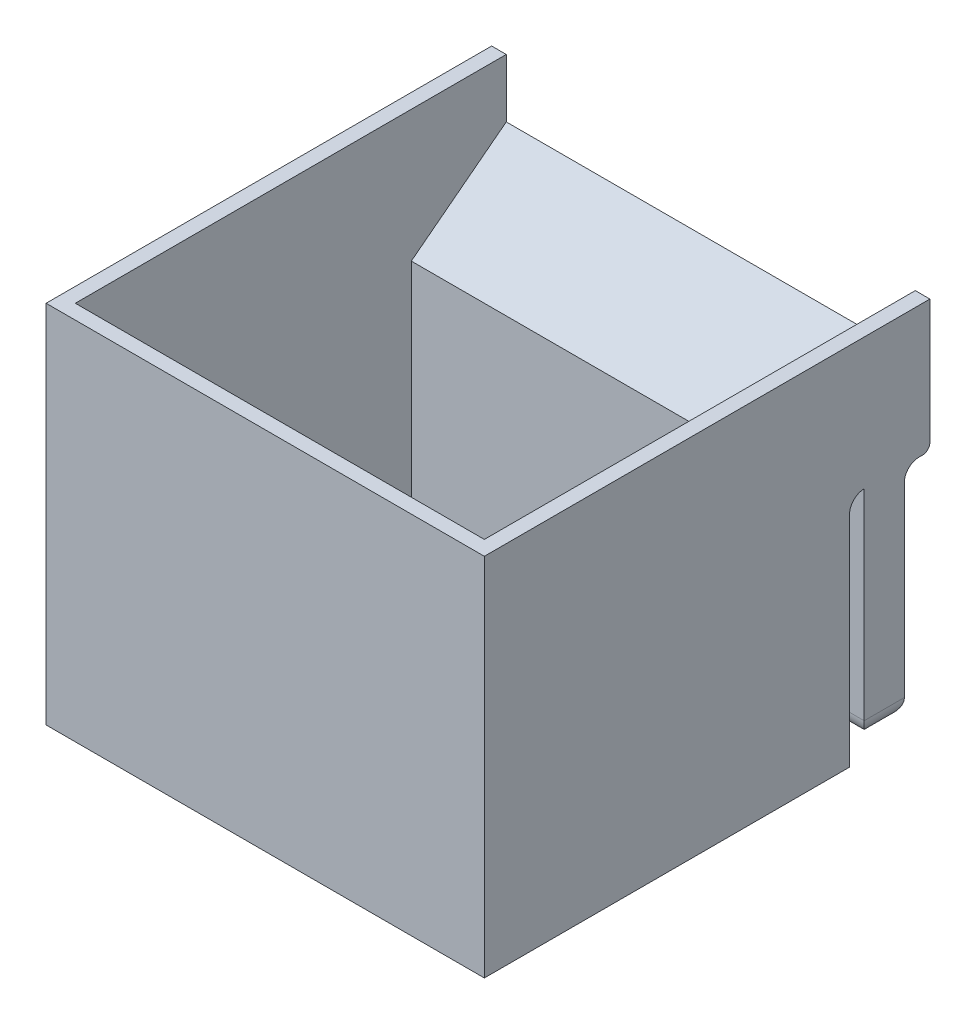
ISO-10303-21;
HEADER;
FILE_DESCRIPTION(('STEP AP214'),'2;1');
FILE_NAME('part.step','',(''),(''),'','','');
FILE_SCHEMA(('AUTOMOTIVE_DESIGN { 1 0 10303 214 1 1 1 1 }'));
ENDSEC;
DATA;
#1=APPLICATION_CONTEXT('core data for automotive mechanical design processes');
#2=APPLICATION_PROTOCOL_DEFINITION('international standard','automotive_design',2000,#1);
#3=PRODUCT_CONTEXT('',#1,'mechanical');
#4=PRODUCT('Part','Part','',(#3));
#5=PRODUCT_RELATED_PRODUCT_CATEGORY('part','',(#4));
#6=PRODUCT_DEFINITION_FORMATION('','',#4);
#7=PRODUCT_DEFINITION_CONTEXT('part definition',#1,'design');
#8=PRODUCT_DEFINITION('design','',#6,#7);
#9=PRODUCT_DEFINITION_SHAPE('','',#8);
#10=(LENGTH_UNIT() NAMED_UNIT(*) SI_UNIT(.MILLI.,.METRE.));
#11=(NAMED_UNIT(*) PLANE_ANGLE_UNIT() SI_UNIT($,.RADIAN.));
#12=(NAMED_UNIT(*) SI_UNIT($,.STERADIAN.) SOLID_ANGLE_UNIT());
#13=UNCERTAINTY_MEASURE_WITH_UNIT(LENGTH_MEASURE(1.E-05),#10,'distance_accuracy_value','');
#14=(GEOMETRIC_REPRESENTATION_CONTEXT(3) GLOBAL_UNCERTAINTY_ASSIGNED_CONTEXT((#13)) GLOBAL_UNIT_ASSIGNED_CONTEXT((#10,
#11,#12)) REPRESENTATION_CONTEXT('',''));
#15=CARTESIAN_POINT('',(0.,0.,0.));
#16=DIRECTION('',(0.,0.,1.));
#17=DIRECTION('',(1.,0.,0.));
#18=AXIS2_PLACEMENT_3D('',#15,#16,#17);
#19=CARTESIAN_POINT('',(60.,21.5335689045936,-18.7455830388693));
#20=DIRECTION('',(0.,-0.7926239891046,-0.609710760849693));
#21=DIRECTION('',(0.,0.609710760849693,-0.7926239891046));
#22=AXIS2_PLACEMENT_3D('',#19,#20,#21);
#23=PLANE('',#22);
#24=DIRECTION('',(0.,-0.609710760849693,0.7926239891046));
#25=VECTOR('',#24,1.);
#26=CARTESIAN_POINT('',(58.,21.5335689045936,-18.7455830388693));
#27=LINE('',#26,#25);
#28=CARTESIAN_POINT('',(58.,21.5335689045936,-18.7455830388693));
#29=VERTEX_POINT('',#28);
#30=CARTESIAN_POINT('',(58.,11.5335689045936,-5.74558303886929));
#31=VERTEX_POINT('',#30);
#32=EDGE_CURVE('E213',#29,#31,#27,.T.);
#33=ORIENTED_EDGE('',*,*,#32,.F.);
#34=DIRECTION('',(-1.,0.,0.));
#35=VECTOR('',#34,1.);
#36=CARTESIAN_POINT('',(60.,21.5335689045936,-18.7455830388693));
#37=LINE('',#36,#35);
#38=CARTESIAN_POINT('',(2.,21.5335689045936,-18.7455830388693));
#39=VERTEX_POINT('',#38);
#40=EDGE_CURVE('E203',#29,#39,#37,.T.);
#41=ORIENTED_EDGE('',*,*,#40,.T.);
#42=DIRECTION('',(0.,0.609710760849693,-0.7926239891046));
#43=VECTOR('',#42,1.);
#44=CARTESIAN_POINT('',(2.,21.5335689045936,-18.7455830388693));
#45=LINE('',#44,#43);
#46=CARTESIAN_POINT('',(2.,11.5335689045936,-5.74558303886929));
#47=VERTEX_POINT('',#46);
#48=EDGE_CURVE('E225',#47,#39,#45,.T.);
#49=ORIENTED_EDGE('',*,*,#48,.F.);
#50=DIRECTION('',(-1.,0.,0.));
#51=VECTOR('',#50,1.);
#52=CARTESIAN_POINT('',(60.,11.5335689045936,-5.74558303886929));
#53=LINE('',#52,#51);
#54=EDGE_CURVE('E312',#31,#47,#53,.T.);
#55=ORIENTED_EDGE('',*,*,#54,.F.);
#56=EDGE_LOOP('',(#33,#41,#49,#55));
#57=FACE_BOUND('',#56,.T.);
#58=ADVANCED_FACE('F45',(#57),#23,.F.);
#59=CARTESIAN_POINT('',(60.,11.5335689045936,-5.74558303886929));
#60=DIRECTION('',(0.,0.,-1.));
#61=DIRECTION('',(0.,1.,0.));
#62=AXIS2_PLACEMENT_3D('',#59,#60,#61);
#63=PLANE('',#62);
#64=DIRECTION('',(0.,-1.,0.));
#65=VECTOR('',#64,1.);
#66=CARTESIAN_POINT('',(58.,29.5335689045936,-5.74558303886929));
#67=LINE('',#66,#65);
#68=CARTESIAN_POINT('',(58.,-18.4664310954064,-5.74558303886929));
#69=VERTEX_POINT('',#68);
#70=EDGE_CURVE('E233',#31,#69,#67,.T.);
#71=ORIENTED_EDGE('',*,*,#70,.F.);
#72=ORIENTED_EDGE('',*,*,#54,.T.);
#73=DIRECTION('',(0.,-1.,0.));
#74=VECTOR('',#73,1.);
#75=CARTESIAN_POINT('',(2.,29.5335689045936,-5.74558303886929));
#76=LINE('',#75,#74);
#77=CARTESIAN_POINT('',(2.,-18.4664310954064,-5.74558303886929));
#78=VERTEX_POINT('',#77);
#79=EDGE_CURVE('E248',#47,#78,#76,.T.);
#80=ORIENTED_EDGE('',*,*,#79,.T.);
#81=DIRECTION('',(-1.,0.,0.));
#82=VECTOR('',#81,1.);
#83=CARTESIAN_POINT('',(60.,-18.4664310954064,-5.74558303886929));
#84=LINE('',#83,#82);
#85=EDGE_CURVE('E309',#69,#78,#84,.T.);
#86=ORIENTED_EDGE('',*,*,#85,.F.);
#87=EDGE_LOOP('',(#71,#72,#80,#86));
#88=FACE_BOUND('',#87,.T.);
#89=ADVANCED_FACE('F443',(#88),#63,.F.);
#90=CARTESIAN_POINT('',(60.,-18.4664310954064,-5.74558303886929));
#91=DIRECTION('',(0.,-1.,0.));
#92=DIRECTION('',(0.,0.,-1.));
#93=AXIS2_PLACEMENT_3D('',#90,#91,#92);
#94=PLANE('',#93);
#95=DIRECTION('',(0.,0.,1.));
#96=VECTOR('',#95,1.);
#97=CARTESIAN_POINT('',(58.,-18.4664310954064,0.));
#98=LINE('',#97,#96);
#99=CARTESIAN_POINT('',(58.,-18.4664310954064,40.2544169611307));
#100=VERTEX_POINT('',#99);
#101=EDGE_CURVE('E194',#69,#100,#98,.T.);
#102=ORIENTED_EDGE('',*,*,#101,.F.);
#103=ORIENTED_EDGE('',*,*,#85,.T.);
#104=DIRECTION('',(0.,0.,1.));
#105=VECTOR('',#104,1.);
#106=CARTESIAN_POINT('',(2.,-18.4664310954064,0.));
#107=LINE('',#106,#105);
#108=CARTESIAN_POINT('',(2.00000000000001,-18.4664310954064,40.2544169611307));
#109=VERTEX_POINT('',#108);
#110=EDGE_CURVE('E236',#78,#109,#107,.T.);
#111=ORIENTED_EDGE('',*,*,#110,.T.);
#112=DIRECTION('',(-1.,0.,0.));
#113=VECTOR('',#112,1.);
#114=CARTESIAN_POINT('',(60.,-18.4664310954064,40.2544169611307));
#115=LINE('',#114,#113);
#116=EDGE_CURVE('E306',#100,#109,#115,.T.);
#117=ORIENTED_EDGE('',*,*,#116,.F.);
#118=EDGE_LOOP('',(#102,#103,#111,#117));
#119=FACE_BOUND('',#118,.T.);
#120=ADVANCED_FACE('F449',(#119),#94,.F.);
#121=CARTESIAN_POINT('',(60.,-18.4664310954064,40.2544169611307));
#122=DIRECTION('',(0.,0.,1.));
#123=DIRECTION('',(1.,0.,0.));
#124=AXIS2_PLACEMENT_3D('',#121,#122,#123);
#125=PLANE('',#124);
#126=DIRECTION('',(0.,-1.,0.));
#127=VECTOR('',#126,1.);
#128=CARTESIAN_POINT('',(58.,29.5335689045936,40.2544169611307));
#129=LINE('',#128,#127);
#130=CARTESIAN_POINT('',(58.,29.5335689045936,40.2544169611307));
#131=VERTEX_POINT('',#130);
#132=EDGE_CURVE('E189',#131,#100,#129,.T.);
#133=ORIENTED_EDGE('',*,*,#132,.T.);
#134=ORIENTED_EDGE('',*,*,#116,.T.);
#135=DIRECTION('',(0.,-1.,0.));
#136=VECTOR('',#135,1.);
#137=CARTESIAN_POINT('',(2.00000000000001,29.5335689045936,40.2544169611307));
#138=LINE('',#137,#136);
#139=CARTESIAN_POINT('',(2.00000000000001,29.5335689045936,40.2544169611307));
#140=VERTEX_POINT('',#139);
#141=EDGE_CURVE('E241',#140,#109,#138,.T.);
#142=ORIENTED_EDGE('',*,*,#141,.F.);
#143=DIRECTION('',(-1.,0.,0.));
#144=VECTOR('',#143,1.);
#145=CARTESIAN_POINT('',(60.,29.5335689045936,40.2544169611307));
#146=LINE('',#145,#144);
#147=EDGE_CURVE('E285',#131,#140,#146,.T.);
#148=ORIENTED_EDGE('',*,*,#147,.F.);
#149=EDGE_LOOP('',(#133,#134,#142,#148));
#150=FACE_BOUND('',#149,.T.);
#151=ADVANCED_FACE('F461',(#150),#125,.F.);
#152=CARTESIAN_POINT('',(60.,11.5335689045936,-7.74558303886929));
#153=DIRECTION('',(0.,1.,0.));
#154=DIRECTION('',(0.,0.,1.));
#155=AXIS2_PLACEMENT_3D('',#152,#153,#154);
#156=PLANE('',#155);
#157=DIRECTION('',(0.,0.,-1.));
#158=VECTOR('',#157,1.);
#159=CARTESIAN_POINT('',(0.,11.5335689045936,-7.74558303886929));
#160=LINE('',#159,#158);
#161=CARTESIAN_POINT('',(0.,11.5335689045936,-17.2455830388693));
#162=VERTEX_POINT('',#161);
#163=CARTESIAN_POINT('',(0.,11.5335689045936,-17.7455830388693));
#164=VERTEX_POINT('',#163);
#165=EDGE_CURVE('E298',#162,#164,#160,.T.);
#166=ORIENTED_EDGE('',*,*,#165,.T.);
#167=DIRECTION('',(-1.,0.,0.));
#168=VECTOR('',#167,1.);
#169=CARTESIAN_POINT('',(60.,11.5335689045936,-17.7455830388693));
#170=LINE('',#169,#168);
#171=CARTESIAN_POINT('',(60.,11.5335689045936,-17.7455830388693));
#172=VERTEX_POINT('',#171);
#173=EDGE_CURVE('E365',#164,#172,#170,.F.);
#174=ORIENTED_EDGE('',*,*,#173,.T.);
#175=DIRECTION('',(0.,0.,-1.));
#176=VECTOR('',#175,1.);
#177=CARTESIAN_POINT('',(60.,11.5335689045936,-7.74558303886929));
#178=LINE('',#177,#176);
#179=CARTESIAN_POINT('',(60.,11.5335689045936,-17.2455830388693));
#180=VERTEX_POINT('',#179);
#181=EDGE_CURVE('E278',#180,#172,#178,.T.);
#182=ORIENTED_EDGE('',*,*,#181,.F.);
#183=DIRECTION('',(1.,0.,0.));
#184=VECTOR('',#183,1.);
#185=CARTESIAN_POINT('',(0.,11.5335689045936,-17.2455830388693));
#186=LINE('',#185,#184);
#187=EDGE_CURVE('E348',#180,#162,#186,.F.);
#188=ORIENTED_EDGE('',*,*,#187,.T.);
#189=EDGE_LOOP('',(#166,#174,#182,#188));
#190=FACE_BOUND('',#189,.T.);
#191=ADVANCED_FACE('F458',(#190),#156,.F.);
#192=CARTESIAN_POINT('',(60.,29.5335689045936,40.2544169611307));
#193=DIRECTION('',(0.,-1.,0.));
#194=DIRECTION('',(0.,0.,-1.));
#195=AXIS2_PLACEMENT_3D('',#192,#193,#194);
#196=PLANE('',#195);
#197=DIRECTION('',(0.,0.,1.));
#198=VECTOR('',#197,1.);
#199=CARTESIAN_POINT('',(0.,29.5335689045936,40.2544169611307));
#200=LINE('',#199,#198);
#201=CARTESIAN_POINT('',(0.,29.5335689045936,-18.7455830388693));
#202=VERTEX_POINT('',#201);
#203=CARTESIAN_POINT('',(0.,29.5335689045936,42.2544169611307));
#204=VERTEX_POINT('',#203);
#205=EDGE_CURVE('E264',#202,#204,#200,.T.);
#206=ORIENTED_EDGE('',*,*,#205,.T.);
#207=DIRECTION('',(-1.,0.,0.));
#208=VECTOR('',#207,1.);
#209=CARTESIAN_POINT('',(60.,29.5335689045936,42.2544169611307));
#210=LINE('',#209,#208);
#211=CARTESIAN_POINT('',(60.,29.5335689045936,42.2544169611307));
#212=VERTEX_POINT('',#211);
#213=EDGE_CURVE('E326',#212,#204,#210,.T.);
#214=ORIENTED_EDGE('',*,*,#213,.F.);
#215=DIRECTION('',(0.,0.,1.));
#216=VECTOR('',#215,1.);
#217=CARTESIAN_POINT('',(60.,29.5335689045936,40.2544169611307));
#218=LINE('',#217,#216);
#219=CARTESIAN_POINT('',(60.,29.5335689045936,-18.7455830388693));
#220=VERTEX_POINT('',#219);
#221=EDGE_CURVE('E211',#220,#212,#218,.T.);
#222=ORIENTED_EDGE('',*,*,#221,.F.);
#223=DIRECTION('',(1.,0.,0.));
#224=VECTOR('',#223,1.);
#225=CARTESIAN_POINT('',(60.,29.5335689045936,-18.7455830388693));
#226=LINE('',#225,#224);
#227=CARTESIAN_POINT('',(58.,29.5335689045936,-18.7455830388693));
#228=VERTEX_POINT('',#227);
#229=EDGE_CURVE('E201',#228,#220,#226,.T.);
#230=ORIENTED_EDGE('',*,*,#229,.F.);
#231=DIRECTION('',(0.,0.,1.));
#232=VECTOR('',#231,1.);
#233=CARTESIAN_POINT('',(58.,29.5335689045936,0.));
#234=LINE('',#233,#232);
#235=EDGE_CURVE('E183',#228,#131,#234,.T.);
#236=ORIENTED_EDGE('',*,*,#235,.T.);
#237=ORIENTED_EDGE('',*,*,#147,.T.);
#238=DIRECTION('',(0.,0.,1.));
#239=VECTOR('',#238,1.);
#240=CARTESIAN_POINT('',(2.,29.5335689045936,0.));
#241=LINE('',#240,#239);
#242=CARTESIAN_POINT('',(2.,29.5335689045936,-18.7455830388693));
#243=VERTEX_POINT('',#242);
#244=EDGE_CURVE('E237',#243,#140,#241,.T.);
#245=ORIENTED_EDGE('',*,*,#244,.F.);
#246=DIRECTION('',(1.,0.,0.));
#247=VECTOR('',#246,1.);
#248=CARTESIAN_POINT('',(2.,29.5335689045936,-18.7455830388693));
#249=LINE('',#248,#247);
#250=EDGE_CURVE('E221',#202,#243,#249,.T.);
#251=ORIENTED_EDGE('',*,*,#250,.F.);
#252=EDGE_LOOP('',(#206,#214,#222,#230,#236,#237,#245,#251));
#253=FACE_BOUND('',#252,.T.);
#254=ADVANCED_FACE('F208',(#253),#196,.F.);
#255=CARTESIAN_POINT('',(60.,29.5335689045936,42.2544169611307));
#256=DIRECTION('',(0.,0.,-1.));
#257=DIRECTION('',(0.,1.,0.));
#258=AXIS2_PLACEMENT_3D('',#255,#256,#257);
#259=PLANE('',#258);
#260=DIRECTION('',(0.,-1.,0.));
#261=VECTOR('',#260,1.);
#262=CARTESIAN_POINT('',(0.,29.5335689045936,42.2544169611307));
#263=LINE('',#262,#261);
#264=CARTESIAN_POINT('',(0.,-20.4664310954064,42.2544169611307));
#265=VERTEX_POINT('',#264);
#266=EDGE_CURVE('E288',#204,#265,#263,.T.);
#267=ORIENTED_EDGE('',*,*,#266,.T.);
#268=DIRECTION('',(-1.,0.,0.));
#269=VECTOR('',#268,1.);
#270=CARTESIAN_POINT('',(60.,-20.4664310954064,42.2544169611307));
#271=LINE('',#270,#269);
#272=CARTESIAN_POINT('',(60.,-20.4664310954064,42.2544169611307));
#273=VERTEX_POINT('',#272);
#274=EDGE_CURVE('E322',#273,#265,#271,.T.);
#275=ORIENTED_EDGE('',*,*,#274,.F.);
#276=DIRECTION('',(0.,-1.,0.));
#277=VECTOR('',#276,1.);
#278=CARTESIAN_POINT('',(60.,29.5335689045936,42.2544169611307));
#279=LINE('',#278,#277);
#280=EDGE_CURVE('E267',#212,#273,#279,.T.);
#281=ORIENTED_EDGE('',*,*,#280,.F.);
#282=ORIENTED_EDGE('',*,*,#213,.T.);
#283=EDGE_LOOP('',(#267,#275,#281,#282));
#284=FACE_BOUND('',#283,.T.);
#285=ADVANCED_FACE('F469',(#284),#259,.F.);
#286=CARTESIAN_POINT('',(60.,-20.4664310954064,42.2544169611307));
#287=DIRECTION('',(0.,1.,0.));
#288=DIRECTION('',(0.,0.,1.));
#289=AXIS2_PLACEMENT_3D('',#286,#287,#288);
#290=PLANE('',#289);
#291=DIRECTION('',(0.,0.,-1.));
#292=VECTOR('',#291,1.);
#293=CARTESIAN_POINT('',(0.,-20.4664310954064,42.2544169611307));
#294=LINE('',#293,#292);
#295=CARTESIAN_POINT('',(0.,-20.4664310954064,-7.74558303886929));
#296=VERTEX_POINT('',#295);
#297=EDGE_CURVE('E291',#265,#296,#294,.T.);
#298=ORIENTED_EDGE('',*,*,#297,.T.);
#299=DIRECTION('',(-1.,0.,0.));
#300=VECTOR('',#299,1.);
#301=CARTESIAN_POINT('',(60.,-20.4664310954064,-7.74558303886929));
#302=LINE('',#301,#300);
#303=CARTESIAN_POINT('',(60.,-20.4664310954064,-7.74558303886929));
#304=VERTEX_POINT('',#303);
#305=EDGE_CURVE('E318',#304,#296,#302,.T.);
#306=ORIENTED_EDGE('',*,*,#305,.F.);
#307=DIRECTION('',(0.,0.,-1.));
#308=VECTOR('',#307,1.);
#309=CARTESIAN_POINT('',(60.,-20.4664310954064,42.2544169611307));
#310=LINE('',#309,#308);
#311=EDGE_CURVE('E271',#273,#304,#310,.T.);
#312=ORIENTED_EDGE('',*,*,#311,.F.);
#313=ORIENTED_EDGE('',*,*,#274,.T.);
#314=EDGE_LOOP('',(#298,#306,#312,#313));
#315=FACE_BOUND('',#314,.T.);
#316=ADVANCED_FACE('F465',(#315),#290,.F.);
#317=CARTESIAN_POINT('',(60.,-20.4664310954064,-7.74558303886929));
#318=DIRECTION('',(0.,0.,1.));
#319=DIRECTION('',(0.,-1.,0.));
#320=AXIS2_PLACEMENT_3D('',#317,#318,#319);
#321=PLANE('',#320);
#322=DIRECTION('',(0.,1.,0.));
#323=VECTOR('',#322,1.);
#324=CARTESIAN_POINT('',(0.,-20.4664310954064,-7.74558303886929));
#325=LINE('',#324,#323);
#326=CARTESIAN_POINT('',(0.,9.53356890459363,-7.74558303886929));
#327=VERTEX_POINT('',#326);
#328=EDGE_CURVE('E294',#296,#327,#325,.T.);
#329=ORIENTED_EDGE('',*,*,#328,.T.);
#330=DIRECTION('',(-1.,0.,0.));
#331=VECTOR('',#330,1.);
#332=CARTESIAN_POINT('',(60.,9.53356890459363,-7.74558303886929));
#333=LINE('',#332,#331);
#334=CARTESIAN_POINT('',(60.,9.53356890459363,-7.74558303886929));
#335=VERTEX_POINT('',#334);
#336=EDGE_CURVE('E334',#327,#335,#333,.F.);
#337=ORIENTED_EDGE('',*,*,#336,.T.);
#338=DIRECTION('',(0.,1.,0.));
#339=VECTOR('',#338,1.);
#340=CARTESIAN_POINT('',(60.,-20.4664310954064,-7.74558303886929));
#341=LINE('',#340,#339);
#342=EDGE_CURVE('E274',#304,#335,#341,.T.);
#343=ORIENTED_EDGE('',*,*,#342,.F.);
#344=ORIENTED_EDGE('',*,*,#305,.T.);
#345=EDGE_LOOP('',(#329,#337,#343,#344));
#346=FACE_BOUND('',#345,.T.);
#347=ADVANCED_FACE('F457',(#346),#321,.F.);
#348=CARTESIAN_POINT('',(60.,11.5335689045936,-18.7455830388693));
#349=DIRECTION('',(0.,0.,1.));
#350=DIRECTION('',(0.,-1.,0.));
#351=AXIS2_PLACEMENT_3D('',#348,#349,#350);
#352=PLANE('',#351);
#353=DIRECTION('',(0.,1.,0.));
#354=VECTOR('',#353,1.);
#355=CARTESIAN_POINT('',(60.,11.5335689045936,-18.7455830388693));
#356=LINE('',#355,#354);
#357=CARTESIAN_POINT('',(60.,12.5335689045936,-18.7455830388693));
#358=VERTEX_POINT('',#357);
#359=EDGE_CURVE('E282',#358,#220,#356,.T.);
#360=ORIENTED_EDGE('',*,*,#359,.F.);
#361=DIRECTION('',(-1.,0.,0.));
#362=VECTOR('',#361,1.);
#363=CARTESIAN_POINT('',(60.,12.5335689045936,-18.7455830388693));
#364=LINE('',#363,#362);
#365=CARTESIAN_POINT('',(0.,12.5335689045936,-18.7455830388693));
#366=VERTEX_POINT('',#365);
#367=EDGE_CURVE('E358',#358,#366,#364,.T.);
#368=ORIENTED_EDGE('',*,*,#367,.T.);
#369=DIRECTION('',(0.,1.,0.));
#370=VECTOR('',#369,1.);
#371=CARTESIAN_POINT('',(0.,11.5335689045936,-18.7455830388693));
#372=LINE('',#371,#370);
#373=EDGE_CURVE('E268',#366,#202,#372,.T.);
#374=ORIENTED_EDGE('',*,*,#373,.T.);
#375=ORIENTED_EDGE('',*,*,#250,.T.);
#376=DIRECTION('',(0.,-1.,0.));
#377=VECTOR('',#376,1.);
#378=CARTESIAN_POINT('',(2.,29.5335689045936,-18.7455830388693));
#379=LINE('',#378,#377);
#380=EDGE_CURVE('E216',#243,#39,#379,.T.);
#381=ORIENTED_EDGE('',*,*,#380,.T.);
#382=ORIENTED_EDGE('',*,*,#40,.F.);
#383=DIRECTION('',(0.,1.,0.));
#384=VECTOR('',#383,1.);
#385=CARTESIAN_POINT('',(58.,29.5335689045936,-18.7455830388693));
#386=LINE('',#385,#384);
#387=EDGE_CURVE('E186',#29,#228,#386,.T.);
#388=ORIENTED_EDGE('',*,*,#387,.T.);
#389=ORIENTED_EDGE('',*,*,#229,.T.);
#390=EDGE_LOOP('',(#360,#368,#374,#375,#381,#382,#388,#389));
#391=FACE_BOUND('',#390,.T.);
#392=ADVANCED_FACE('F200',(#391),#352,.F.);
#393=CARTESIAN_POINT('',(60.,0.,0.));
#394=DIRECTION('',(1.,0.,0.));
#395=DIRECTION('',(0.,0.,-1.));
#396=AXIS2_PLACEMENT_3D('',#393,#394,#395);
#397=PLANE('',#396);
#398=DIRECTION('',(0.,1.,0.));
#399=VECTOR('',#398,1.);
#400=CARTESIAN_POINT('',(60.,-18.4664310954064,-9.7455830388693));
#401=LINE('',#400,#399);
#402=CARTESIAN_POINT('',(60.,-15.9664310954064,-9.7455830388693));
#403=VERTEX_POINT('',#402);
#404=CARTESIAN_POINT('',(60.,11.5335689045936,-9.74558303886929));
#405=VERTEX_POINT('',#404);
#406=EDGE_CURVE('E258',#403,#405,#401,.T.);
#407=ORIENTED_EDGE('',*,*,#406,.F.);
#408=DIRECTION('',(0.,0.,-1.));
#409=VECTOR('',#408,1.);
#410=CARTESIAN_POINT('',(60.,-15.9664310954064,-15.2455830388693));
#411=LINE('',#410,#409);
#412=CARTESIAN_POINT('',(60.,-15.9664310954064,-15.2455830388693));
#413=VERTEX_POINT('',#412);
#414=EDGE_CURVE('E63',#403,#413,#411,.T.);
#415=ORIENTED_EDGE('',*,*,#414,.T.);
#416=DIRECTION('',(0.,1.,0.));
#417=VECTOR('',#416,1.);
#418=CARTESIAN_POINT('',(60.,-18.4664310954064,-15.2455830388693));
#419=LINE('',#418,#417);
#420=CARTESIAN_POINT('',(60.,9.53356890459363,-15.2455830388693));
#421=VERTEX_POINT('',#420);
#422=EDGE_CURVE('E261',#413,#421,#419,.T.);
#423=ORIENTED_EDGE('',*,*,#422,.T.);
#424=CARTESIAN_POINT('',(60.,9.53356890459363,-17.2455830388693));
#425=DIRECTION('',(1.,0.,0.));
#426=DIRECTION('',(0.,0.,-1.));
#427=AXIS2_PLACEMENT_3D('',#424,#425,#426);
#428=CIRCLE('',#427,2.);
#429=EDGE_CURVE('E351',#421,#180,#428,.F.);
#430=ORIENTED_EDGE('',*,*,#429,.T.);
#431=ORIENTED_EDGE('',*,*,#181,.T.);
#432=CARTESIAN_POINT('',(60.,12.5335689045936,-17.7455830388693));
#433=DIRECTION('',(1.,0.,0.));
#434=DIRECTION('',(0.,0.,-1.));
#435=AXIS2_PLACEMENT_3D('',#432,#433,#434);
#436=CIRCLE('',#435,1.);
#437=EDGE_CURVE('E368',#172,#358,#436,.T.);
#438=ORIENTED_EDGE('',*,*,#437,.T.);
#439=ORIENTED_EDGE('',*,*,#359,.T.);
#440=ORIENTED_EDGE('',*,*,#221,.T.);
#441=ORIENTED_EDGE('',*,*,#280,.T.);
#442=ORIENTED_EDGE('',*,*,#311,.T.);
#443=ORIENTED_EDGE('',*,*,#342,.T.);
#444=CARTESIAN_POINT('',(60.,9.53356890459363,-9.74558303886929));
#445=DIRECTION('',(1.,0.,0.));
#446=DIRECTION('',(0.,0.,-1.));
#447=AXIS2_PLACEMENT_3D('',#444,#445,#446);
#448=CIRCLE('',#447,2.);
#449=EDGE_CURVE('E340',#335,#405,#448,.F.);
#450=ORIENTED_EDGE('',*,*,#449,.T.);
#451=EDGE_LOOP('',(#407,#415,#423,#430,#431,#438,#439,#440,#441,#442,#443,#450));
#452=FACE_BOUND('',#451,.T.);
#453=ADVANCED_FACE('F456',(#452),#397,.T.);
#454=CARTESIAN_POINT('',(0.,0.,0.));
#455=DIRECTION('',(1.,0.,0.));
#456=DIRECTION('',(0.,0.,-1.));
#457=AXIS2_PLACEMENT_3D('',#454,#455,#456);
#458=PLANE('',#457);
#459=DIRECTION('',(0.,1.,0.));
#460=VECTOR('',#459,1.);
#461=CARTESIAN_POINT('',(0.,-18.4664310954064,-15.2455830388693));
#462=LINE('',#461,#460);
#463=CARTESIAN_POINT('',(0.,-15.9664310954064,-15.2455830388693));
#464=VERTEX_POINT('',#463);
#465=CARTESIAN_POINT('',(0.,9.53356890459363,-15.2455830388693));
#466=VERTEX_POINT('',#465);
#467=EDGE_CURVE('E252',#464,#466,#462,.T.);
#468=ORIENTED_EDGE('',*,*,#467,.F.);
#469=DIRECTION('',(0.,0.,-1.));
#470=VECTOR('',#469,1.);
#471=CARTESIAN_POINT('',(0.,-15.9664310954064,0.));
#472=LINE('',#471,#470);
#473=CARTESIAN_POINT('',(0.,-15.9664310954064,-9.7455830388693));
#474=VERTEX_POINT('',#473);
#475=EDGE_CURVE('E384',#464,#474,#472,.F.);
#476=ORIENTED_EDGE('',*,*,#475,.T.);
#477=DIRECTION('',(0.,1.,0.));
#478=VECTOR('',#477,1.);
#479=CARTESIAN_POINT('',(0.,-18.4664310954064,-9.7455830388693));
#480=LINE('',#479,#478);
#481=CARTESIAN_POINT('',(0.,11.5335689045936,-9.74558303886929));
#482=VERTEX_POINT('',#481);
#483=EDGE_CURVE('E255',#474,#482,#480,.T.);
#484=ORIENTED_EDGE('',*,*,#483,.T.);
#485=CARTESIAN_POINT('',(0.,9.53356890459363,-9.74558303886929));
#486=DIRECTION('',(1.,0.,0.));
#487=DIRECTION('',(0.,0.,-1.));
#488=AXIS2_PLACEMENT_3D('',#485,#486,#487);
#489=CIRCLE('',#488,2.);
#490=EDGE_CURVE('E337',#482,#327,#489,.T.);
#491=ORIENTED_EDGE('',*,*,#490,.T.);
#492=ORIENTED_EDGE('',*,*,#328,.F.);
#493=ORIENTED_EDGE('',*,*,#297,.F.);
#494=ORIENTED_EDGE('',*,*,#266,.F.);
#495=ORIENTED_EDGE('',*,*,#205,.F.);
#496=ORIENTED_EDGE('',*,*,#373,.F.);
#497=CARTESIAN_POINT('',(0.,12.5335689045936,-17.7455830388693));
#498=DIRECTION('',(1.,0.,0.));
#499=DIRECTION('',(0.,0.,-1.));
#500=AXIS2_PLACEMENT_3D('',#497,#498,#499);
#501=CIRCLE('',#500,1.);
#502=EDGE_CURVE('E362',#366,#164,#501,.F.);
#503=ORIENTED_EDGE('',*,*,#502,.T.);
#504=ORIENTED_EDGE('',*,*,#165,.F.);
#505=CARTESIAN_POINT('',(0.,9.53356890459363,-17.2455830388693));
#506=DIRECTION('',(1.,0.,0.));
#507=DIRECTION('',(0.,0.,-1.));
#508=AXIS2_PLACEMENT_3D('',#505,#506,#507);
#509=CIRCLE('',#508,2.);
#510=EDGE_CURVE('E354',#162,#466,#509,.T.);
#511=ORIENTED_EDGE('',*,*,#510,.T.);
#512=EDGE_LOOP('',(#468,#476,#484,#491,#492,#493,#494,#495,#496,#503,#504,#511));
#513=FACE_BOUND('',#512,.T.);
#514=ADVANCED_FACE('F420',(#513),#458,.F.);
#515=CARTESIAN_POINT('',(60.,9.53356890459363,-9.74558303886929));
#516=DIRECTION('',(1.,0.,0.));
#517=DIRECTION('',(0.,0.,-1.));
#518=AXIS2_PLACEMENT_3D('',#515,#516,#517);
#519=CYLINDRICAL_SURFACE('',#518,2.);
#520=ORIENTED_EDGE('',*,*,#449,.F.);
#521=ORIENTED_EDGE('',*,*,#336,.F.);
#522=ORIENTED_EDGE('',*,*,#490,.F.);
#523=DIRECTION('',(-1.,0.,0.));
#524=VECTOR('',#523,1.);
#525=CARTESIAN_POINT('',(0.,11.5335689045936,-9.74558303886929));
#526=LINE('',#525,#524);
#527=EDGE_CURVE('E330',#405,#482,#526,.T.);
#528=ORIENTED_EDGE('',*,*,#527,.F.);
#529=EDGE_LOOP('',(#520,#521,#522,#528));
#530=FACE_BOUND('',#529,.T.);
#531=ADVANCED_FACE('F476',(#530),#519,.F.);
#532=CARTESIAN_POINT('',(0.,-18.4664310954064,-15.2455830388693));
#533=DIRECTION('',(0.,0.,1.));
#534=DIRECTION('',(0.,-1.,0.));
#535=AXIS2_PLACEMENT_3D('',#532,#533,#534);
#536=PLANE('',#535);
#537=ORIENTED_EDGE('',*,*,#422,.F.);
#538=DIRECTION('',(1.,0.,0.));
#539=VECTOR('',#538,1.);
#540=CARTESIAN_POINT('',(0.,-15.9664310954064,-15.2455830388693));
#541=LINE('',#540,#539);
#542=EDGE_CURVE('E11',#413,#464,#541,.F.);
#543=ORIENTED_EDGE('',*,*,#542,.T.);
#544=ORIENTED_EDGE('',*,*,#467,.T.);
#545=DIRECTION('',(1.,0.,0.));
#546=VECTOR('',#545,1.);
#547=CARTESIAN_POINT('',(60.,9.53356890459363,-15.2455830388693));
#548=LINE('',#547,#546);
#549=EDGE_CURVE('E344',#466,#421,#548,.T.);
#550=ORIENTED_EDGE('',*,*,#549,.T.);
#551=EDGE_LOOP('',(#537,#543,#544,#550));
#552=FACE_BOUND('',#551,.T.);
#553=ADVANCED_FACE('F417',(#552),#536,.F.);
#554=CARTESIAN_POINT('',(0.,-18.4664310954064,-9.7455830388693));
#555=DIRECTION('',(0.,0.,1.));
#556=DIRECTION('',(0.,-1.,0.));
#557=AXIS2_PLACEMENT_3D('',#554,#555,#556);
#558=PLANE('',#557);
#559=ORIENTED_EDGE('',*,*,#483,.F.);
#560=DIRECTION('',(1.,0.,0.));
#561=VECTOR('',#560,1.);
#562=CARTESIAN_POINT('',(60.,-15.9664310954064,-9.7455830388693));
#563=LINE('',#562,#561);
#564=EDGE_CURVE('E55',#474,#403,#563,.T.);
#565=ORIENTED_EDGE('',*,*,#564,.T.);
#566=ORIENTED_EDGE('',*,*,#406,.T.);
#567=ORIENTED_EDGE('',*,*,#527,.T.);
#568=EDGE_LOOP('',(#559,#565,#566,#567));
#569=FACE_BOUND('',#568,.T.);
#570=ADVANCED_FACE('F431',(#569),#558,.T.);
#571=CARTESIAN_POINT('',(0.,-18.4664310954064,0.));
#572=DIRECTION('',(0.,1.,0.));
#573=DIRECTION('',(0.,0.,1.));
#574=AXIS2_PLACEMENT_3D('',#571,#572,#573);
#575=PLANE('',#574);
#576=DIRECTION('',(0.,0.,-1.));
#577=VECTOR('',#576,1.);
#578=CARTESIAN_POINT('',(57.5,-18.4664310954064,-9.7455830388693));
#579=LINE('',#578,#577);
#580=CARTESIAN_POINT('',(57.5,-18.4664310954064,-12.7455830388693));
#581=VERTEX_POINT('',#580);
#582=CARTESIAN_POINT('',(57.5,-18.4664310954064,-12.2455830388693));
#583=VERTEX_POINT('',#582);
#584=EDGE_CURVE('E374',#581,#583,#579,.F.);
#585=ORIENTED_EDGE('',*,*,#584,.T.);
#586=DIRECTION('',(1.,0.,0.));
#587=VECTOR('',#586,1.);
#588=CARTESIAN_POINT('',(0.,-18.4664310954064,-12.2455830388693));
#589=LINE('',#588,#587);
#590=CARTESIAN_POINT('',(2.5,-18.4664310954064,-12.2455830388693));
#591=VERTEX_POINT('',#590);
#592=EDGE_CURVE('E381',#583,#591,#589,.F.);
#593=ORIENTED_EDGE('',*,*,#592,.T.);
#594=DIRECTION('',(0.,0.,-1.));
#595=VECTOR('',#594,1.);
#596=CARTESIAN_POINT('',(2.5,-18.4664310954064,0.));
#597=LINE('',#596,#595);
#598=CARTESIAN_POINT('',(2.5,-18.4664310954064,-12.7455830388693));
#599=VERTEX_POINT('',#598);
#600=EDGE_CURVE('E377',#591,#599,#597,.T.);
#601=ORIENTED_EDGE('',*,*,#600,.T.);
#602=DIRECTION('',(1.,0.,0.));
#603=VECTOR('',#602,1.);
#604=CARTESIAN_POINT('',(0.,-18.4664310954064,-12.7455830388693));
#605=LINE('',#604,#603);
#606=EDGE_CURVE('E371',#599,#581,#605,.T.);
#607=ORIENTED_EDGE('',*,*,#606,.T.);
#608=EDGE_LOOP('',(#585,#593,#601,#607));
#609=FACE_BOUND('',#608,.T.);
#610=ADVANCED_FACE('F428',(#609),#575,.F.);
#611=CARTESIAN_POINT('',(0.,9.53356890459363,-17.2455830388693));
#612=DIRECTION('',(-1.,0.,0.));
#613=DIRECTION('',(0.,0.,1.));
#614=AXIS2_PLACEMENT_3D('',#611,#612,#613);
#615=CYLINDRICAL_SURFACE('',#614,2.);
#616=ORIENTED_EDGE('',*,*,#510,.F.);
#617=ORIENTED_EDGE('',*,*,#187,.F.);
#618=ORIENTED_EDGE('',*,*,#429,.F.);
#619=ORIENTED_EDGE('',*,*,#549,.F.);
#620=EDGE_LOOP('',(#616,#617,#618,#619));
#621=FACE_BOUND('',#620,.T.);
#622=ADVANCED_FACE('F430',(#621),#615,.F.);
#623=CARTESIAN_POINT('',(2.,29.5335689045936,0.));
#624=DIRECTION('',(1.,0.,0.));
#625=DIRECTION('',(0.,0.,-1.));
#626=AXIS2_PLACEMENT_3D('',#623,#624,#625);
#627=PLANE('',#626);
#628=ORIENTED_EDGE('',*,*,#110,.F.);
#629=ORIENTED_EDGE('',*,*,#79,.F.);
#630=ORIENTED_EDGE('',*,*,#48,.T.);
#631=ORIENTED_EDGE('',*,*,#380,.F.);
#632=ORIENTED_EDGE('',*,*,#244,.T.);
#633=ORIENTED_EDGE('',*,*,#141,.T.);
#634=EDGE_LOOP('',(#628,#629,#630,#631,#632,#633));
#635=FACE_BOUND('',#634,.T.);
#636=ADVANCED_FACE('F437',(#635),#627,.T.);
#637=CARTESIAN_POINT('',(58.,29.5335689045936,0.));
#638=DIRECTION('',(1.,0.,0.));
#639=DIRECTION('',(0.,0.,-1.));
#640=AXIS2_PLACEMENT_3D('',#637,#638,#639);
#641=PLANE('',#640);
#642=ORIENTED_EDGE('',*,*,#101,.T.);
#643=ORIENTED_EDGE('',*,*,#132,.F.);
#644=ORIENTED_EDGE('',*,*,#235,.F.);
#645=ORIENTED_EDGE('',*,*,#387,.F.);
#646=ORIENTED_EDGE('',*,*,#32,.T.);
#647=ORIENTED_EDGE('',*,*,#70,.T.);
#648=EDGE_LOOP('',(#642,#643,#644,#645,#646,#647));
#649=FACE_BOUND('',#648,.T.);
#650=ADVANCED_FACE('F185',(#649),#641,.F.);
#651=CARTESIAN_POINT('',(60.,12.5335689045936,-17.7455830388693));
#652=DIRECTION('',(-1.,0.,0.));
#653=DIRECTION('',(0.,0.,1.));
#654=AXIS2_PLACEMENT_3D('',#651,#652,#653);
#655=CYLINDRICAL_SURFACE('',#654,1.);
#656=ORIENTED_EDGE('',*,*,#437,.F.);
#657=ORIENTED_EDGE('',*,*,#173,.F.);
#658=ORIENTED_EDGE('',*,*,#502,.F.);
#659=ORIENTED_EDGE('',*,*,#367,.F.);
#660=EDGE_LOOP('',(#656,#657,#658,#659));
#661=FACE_BOUND('',#660,.T.);
#662=ADVANCED_FACE('F480',(#661),#655,.T.);
#663=CARTESIAN_POINT('',(57.5,-15.9664310954064,0.));
#664=DIRECTION('',(0.,0.,1.));
#665=DIRECTION('',(1.,0.,0.));
#666=AXIS2_PLACEMENT_3D('',#663,#664,#665);
#667=CYLINDRICAL_SURFACE('',#666,2.5);
#668=CARTESIAN_POINT('',(57.5,-15.9664310954064,-12.7455830388693));
#669=DIRECTION('',(0.707106781186547,0.,0.707106781186547));
#670=DIRECTION('',(0.707106781186547,0.,-0.707106781186547));
#671=AXIS2_PLACEMENT_3D('',#668,#669,#670);
#672=ELLIPSE('',#671,3.53553390593274,2.5);
#673=EDGE_CURVE('E397',#413,#581,#672,.F.);
#674=ORIENTED_EDGE('',*,*,#673,.F.);
#675=ORIENTED_EDGE('',*,*,#414,.F.);
#676=CARTESIAN_POINT('',(57.5,-15.9664310954064,-12.2455830388693));
#677=DIRECTION('',(-0.707106781186547,0.,0.707106781186547));
#678=DIRECTION('',(-0.707106781186547,0.,-0.707106781186547));
#679=AXIS2_PLACEMENT_3D('',#676,#677,#678);
#680=ELLIPSE('',#679,3.53553390593274,2.5);
#681=EDGE_CURVE('E49',#583,#403,#680,.T.);
#682=ORIENTED_EDGE('',*,*,#681,.F.);
#683=ORIENTED_EDGE('',*,*,#584,.F.);
#684=EDGE_LOOP('',(#674,#675,#682,#683));
#685=FACE_BOUND('',#684,.T.);
#686=ADVANCED_FACE('F47',(#685),#667,.T.);
#687=CARTESIAN_POINT('',(0.,-15.9664310954064,-12.2455830388693));
#688=DIRECTION('',(-1.,0.,0.));
#689=DIRECTION('',(0.,0.,1.));
#690=AXIS2_PLACEMENT_3D('',#687,#688,#689);
#691=CYLINDRICAL_SURFACE('',#690,2.5);
#692=ORIENTED_EDGE('',*,*,#681,.T.);
#693=ORIENTED_EDGE('',*,*,#564,.F.);
#694=CARTESIAN_POINT('',(2.5,-15.9664310954064,-12.2455830388693));
#695=DIRECTION('',(-0.707106781186547,0.,-0.707106781186547));
#696=DIRECTION('',(-0.707106781186547,0.,0.707106781186547));
#697=AXIS2_PLACEMENT_3D('',#694,#695,#696);
#698=ELLIPSE('',#697,3.53553390593274,2.5);
#699=EDGE_CURVE('E395',#591,#474,#698,.T.);
#700=ORIENTED_EDGE('',*,*,#699,.F.);
#701=ORIENTED_EDGE('',*,*,#592,.F.);
#702=EDGE_LOOP('',(#692,#693,#700,#701));
#703=FACE_BOUND('',#702,.T.);
#704=ADVANCED_FACE('F409',(#703),#691,.T.);
#705=CARTESIAN_POINT('',(0.,-15.9664310954064,-12.7455830388693));
#706=DIRECTION('',(1.,0.,0.));
#707=DIRECTION('',(0.,0.,-1.));
#708=AXIS2_PLACEMENT_3D('',#705,#706,#707);
#709=CYLINDRICAL_SURFACE('',#708,2.5);
#710=ORIENTED_EDGE('',*,*,#673,.T.);
#711=ORIENTED_EDGE('',*,*,#606,.F.);
#712=CARTESIAN_POINT('',(2.5,-15.9664310954064,-12.7455830388693));
#713=DIRECTION('',(0.707106781186547,0.,-0.707106781186547));
#714=DIRECTION('',(0.707106781186547,0.,0.707106781186547));
#715=AXIS2_PLACEMENT_3D('',#712,#713,#714);
#716=ELLIPSE('',#715,3.53553390593274,2.5);
#717=EDGE_CURVE('E392',#464,#599,#716,.F.);
#718=ORIENTED_EDGE('',*,*,#717,.F.);
#719=ORIENTED_EDGE('',*,*,#542,.F.);
#720=EDGE_LOOP('',(#710,#711,#718,#719));
#721=FACE_BOUND('',#720,.T.);
#722=ADVANCED_FACE('F414',(#721),#709,.T.);
#723=CARTESIAN_POINT('',(2.5,-15.9664310954064,0.));
#724=DIRECTION('',(0.,0.,-1.));
#725=DIRECTION('',(-1.,0.,0.));
#726=AXIS2_PLACEMENT_3D('',#723,#724,#725);
#727=CYLINDRICAL_SURFACE('',#726,2.5);
#728=ORIENTED_EDGE('',*,*,#699,.T.);
#729=ORIENTED_EDGE('',*,*,#475,.F.);
#730=ORIENTED_EDGE('',*,*,#717,.T.);
#731=ORIENTED_EDGE('',*,*,#600,.F.);
#732=EDGE_LOOP('',(#728,#729,#730,#731));
#733=FACE_BOUND('',#732,.T.);
#734=ADVANCED_FACE('F425',(#733),#727,.T.);
#735=CLOSED_SHELL('',(#58,#89,#120,#151,#191,#254,#285,#316,#347,#392,#453,#514,#531,#553,#570,
#610,#622,#636,#650,#662,#686,#704,#722,#734));
#736=MANIFOLD_SOLID_BREP('B2',#735);
#737=ADVANCED_BREP_SHAPE_REPRESENTATION('',(#18,#736),#14);
#738=SHAPE_DEFINITION_REPRESENTATION(#9,#737);
ENDSEC;
END-ISO-10303-21;
